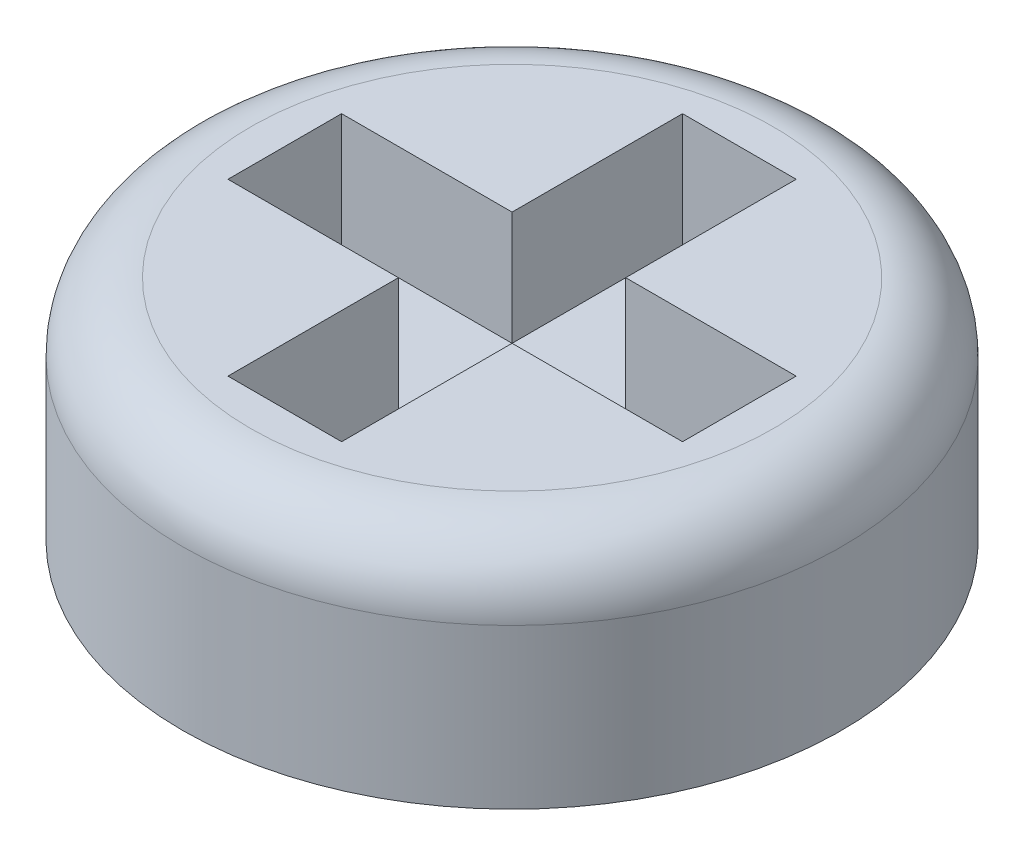
ISO-10303-21;
HEADER;
FILE_DESCRIPTION(('STEP AP214'),'2;1');
FILE_NAME('part.step','',(''),(''),'','','');
FILE_SCHEMA(('AUTOMOTIVE_DESIGN { 1 0 10303 214 1 1 1 1 }'));
ENDSEC;
DATA;
#1=APPLICATION_CONTEXT('core data for automotive mechanical design processes');
#2=APPLICATION_PROTOCOL_DEFINITION('international standard','automotive_design',2000,#1);
#3=PRODUCT_CONTEXT('',#1,'mechanical');
#4=PRODUCT('Part','Part','',(#3));
#5=PRODUCT_RELATED_PRODUCT_CATEGORY('part','',(#4));
#6=PRODUCT_DEFINITION_FORMATION('','',#4);
#7=PRODUCT_DEFINITION_CONTEXT('part definition',#1,'design');
#8=PRODUCT_DEFINITION('design','',#6,#7);
#9=PRODUCT_DEFINITION_SHAPE('','',#8);
#10=(LENGTH_UNIT() NAMED_UNIT(*) SI_UNIT(.MILLI.,.METRE.));
#11=(NAMED_UNIT(*) PLANE_ANGLE_UNIT() SI_UNIT($,.RADIAN.));
#12=(NAMED_UNIT(*) SI_UNIT($,.STERADIAN.) SOLID_ANGLE_UNIT());
#13=UNCERTAINTY_MEASURE_WITH_UNIT(LENGTH_MEASURE(1.E-05),#10,'distance_accuracy_value','');
#14=(GEOMETRIC_REPRESENTATION_CONTEXT(3) GLOBAL_UNCERTAINTY_ASSIGNED_CONTEXT((#13)) GLOBAL_UNIT_ASSIGNED_CONTEXT((#10,
#11,#12)) REPRESENTATION_CONTEXT('',''));
#15=CARTESIAN_POINT('',(0.,0.,0.));
#16=DIRECTION('',(0.,0.,1.));
#17=DIRECTION('',(1.,0.,0.));
#18=AXIS2_PLACEMENT_3D('',#15,#16,#17);
#19=CARTESIAN_POINT('',(0.,1.,0.));
#20=DIRECTION('',(0.,-1.,0.));
#21=DIRECTION('',(0.,0.,-1.));
#22=AXIS2_PLACEMENT_3D('',#19,#20,#21);
#23=CYLINDRICAL_SURFACE('',#22,1.45);
#24=CARTESIAN_POINT('',(0.,0.7,0.));
#25=DIRECTION('',(0.,1.,0.));
#26=DIRECTION('',(0.,0.,1.));
#27=AXIS2_PLACEMENT_3D('',#24,#25,#26);
#28=CIRCLE('',#27,1.45);
#29=CARTESIAN_POINT('',(0.,0.7,1.45));
#30=VERTEX_POINT('',#29);
#31=EDGE_CURVE('E11',#30,#30,#28,.F.);
#32=ORIENTED_EDGE('',*,*,#31,.T.);
#33=EDGE_LOOP('',(#32));
#34=FACE_BOUND('',#33,.T.);
#35=CARTESIAN_POINT('',(0.,0.,0.));
#36=DIRECTION('',(0.,1.,0.));
#37=DIRECTION('',(0.,0.,1.));
#38=AXIS2_PLACEMENT_3D('',#35,#36,#37);
#39=CIRCLE('',#38,1.45);
#40=CARTESIAN_POINT('',(0.,0.,1.45));
#41=VERTEX_POINT('',#40);
#42=EDGE_CURVE('E188',#41,#41,#39,.T.);
#43=ORIENTED_EDGE('',*,*,#42,.T.);
#44=EDGE_LOOP('',(#43));
#45=FACE_BOUND('',#44,.T.);
#46=ADVANCED_FACE('F32',(#34,#45),#23,.T.);
#47=CARTESIAN_POINT('',(0.,1.,0.));
#48=DIRECTION('',(0.,1.,0.));
#49=DIRECTION('',(0.,0.,1.));
#50=AXIS2_PLACEMENT_3D('',#47,#48,#49);
#51=PLANE('',#50);
#52=CARTESIAN_POINT('',(0.,1.,0.));
#53=DIRECTION('',(0.,1.,0.));
#54=DIRECTION('',(0.,0.,1.));
#55=AXIS2_PLACEMENT_3D('',#52,#53,#54);
#56=CIRCLE('',#55,1.15);
#57=CARTESIAN_POINT('',(0.,1.,1.15));
#58=VERTEX_POINT('',#57);
#59=EDGE_CURVE('E40',#58,#58,#56,.T.);
#60=ORIENTED_EDGE('',*,*,#59,.T.);
#61=EDGE_LOOP('',(#60));
#62=FACE_BOUND('',#61,.T.);
#63=DIRECTION('',(-1.,0.,0.));
#64=VECTOR('',#63,1.);
#65=CARTESIAN_POINT('',(0.25,1.,-1.));
#66=LINE('',#65,#64);
#67=CARTESIAN_POINT('',(0.25,1.,-1.));
#68=VERTEX_POINT('',#67);
#69=CARTESIAN_POINT('',(-0.25,1.,-1.));
#70=VERTEX_POINT('',#69);
#71=EDGE_CURVE('E47',#68,#70,#66,.T.);
#72=ORIENTED_EDGE('',*,*,#71,.F.);
#73=DIRECTION('',(0.,0.,-1.));
#74=VECTOR('',#73,1.);
#75=CARTESIAN_POINT('',(0.25,1.,-0.25));
#76=LINE('',#75,#74);
#77=CARTESIAN_POINT('',(0.25,1.,-0.25));
#78=VERTEX_POINT('',#77);
#79=EDGE_CURVE('E184',#78,#68,#76,.T.);
#80=ORIENTED_EDGE('',*,*,#79,.F.);
#81=DIRECTION('',(-1.,0.,0.));
#82=VECTOR('',#81,1.);
#83=CARTESIAN_POINT('',(1.,1.,-0.25));
#84=LINE('',#83,#82);
#85=CARTESIAN_POINT('',(1.,1.,-0.25));
#86=VERTEX_POINT('',#85);
#87=EDGE_CURVE('E182',#86,#78,#84,.T.);
#88=ORIENTED_EDGE('',*,*,#87,.F.);
#89=DIRECTION('',(0.,0.,-1.));
#90=VECTOR('',#89,1.);
#91=CARTESIAN_POINT('',(1.,1.,0.25));
#92=LINE('',#91,#90);
#93=CARTESIAN_POINT('',(1.,1.,0.25));
#94=VERTEX_POINT('',#93);
#95=EDGE_CURVE('E131',#94,#86,#92,.T.);
#96=ORIENTED_EDGE('',*,*,#95,.F.);
#97=DIRECTION('',(1.,0.,0.));
#98=VECTOR('',#97,1.);
#99=CARTESIAN_POINT('',(1.,1.,0.25));
#100=LINE('',#99,#98);
#101=CARTESIAN_POINT('',(0.25,1.,0.25));
#102=VERTEX_POINT('',#101);
#103=EDGE_CURVE('E178',#102,#94,#100,.T.);
#104=ORIENTED_EDGE('',*,*,#103,.F.);
#105=DIRECTION('',(0.,0.,-1.));
#106=VECTOR('',#105,1.);
#107=CARTESIAN_POINT('',(0.25,1.,1.));
#108=LINE('',#107,#106);
#109=CARTESIAN_POINT('',(0.25,1.,1.));
#110=VERTEX_POINT('',#109);
#111=EDGE_CURVE('E175',#110,#102,#108,.T.);
#112=ORIENTED_EDGE('',*,*,#111,.F.);
#113=DIRECTION('',(1.,0.,0.));
#114=VECTOR('',#113,1.);
#115=CARTESIAN_POINT('',(0.25,1.,1.));
#116=LINE('',#115,#114);
#117=CARTESIAN_POINT('',(-0.25,1.,1.));
#118=VERTEX_POINT('',#117);
#119=EDGE_CURVE('E172',#118,#110,#116,.T.);
#120=ORIENTED_EDGE('',*,*,#119,.F.);
#121=DIRECTION('',(0.,0.,1.));
#122=VECTOR('',#121,1.);
#123=CARTESIAN_POINT('',(-0.25,1.,1.));
#124=LINE('',#123,#122);
#125=CARTESIAN_POINT('',(-0.25,1.,0.25));
#126=VERTEX_POINT('',#125);
#127=EDGE_CURVE('E169',#126,#118,#124,.T.);
#128=ORIENTED_EDGE('',*,*,#127,.F.);
#129=DIRECTION('',(1.,0.,0.));
#130=VECTOR('',#129,1.);
#131=CARTESIAN_POINT('',(-0.25,1.,0.25));
#132=LINE('',#131,#130);
#133=CARTESIAN_POINT('',(-1.,1.,0.25));
#134=VERTEX_POINT('',#133);
#135=EDGE_CURVE('E166',#134,#126,#132,.T.);
#136=ORIENTED_EDGE('',*,*,#135,.F.);
#137=DIRECTION('',(0.,0.,1.));
#138=VECTOR('',#137,1.);
#139=CARTESIAN_POINT('',(-1.,1.,0.25));
#140=LINE('',#139,#138);
#141=CARTESIAN_POINT('',(-1.,1.,-0.25));
#142=VERTEX_POINT('',#141);
#143=EDGE_CURVE('E163',#142,#134,#140,.T.);
#144=ORIENTED_EDGE('',*,*,#143,.F.);
#145=DIRECTION('',(-1.,0.,0.));
#146=VECTOR('',#145,1.);
#147=CARTESIAN_POINT('',(-0.25,1.,-0.25));
#148=LINE('',#147,#146);
#149=CARTESIAN_POINT('',(-0.25,1.,-0.25));
#150=VERTEX_POINT('',#149);
#151=EDGE_CURVE('E160',#150,#142,#148,.T.);
#152=ORIENTED_EDGE('',*,*,#151,.F.);
#153=DIRECTION('',(0.,0.,1.));
#154=VECTOR('',#153,1.);
#155=CARTESIAN_POINT('',(-0.25,1.,-0.25));
#156=LINE('',#155,#154);
#157=EDGE_CURVE('E157',#70,#150,#156,.T.);
#158=ORIENTED_EDGE('',*,*,#157,.F.);
#159=EDGE_LOOP('',(#72,#80,#88,#96,#104,#112,#120,#128,#136,#144,#152,#158));
#160=FACE_BOUND('',#159,.T.);
#161=ADVANCED_FACE('F210',(#62,#160),#51,.T.);
#162=CARTESIAN_POINT('',(0.,0.,0.));
#163=DIRECTION('',(0.,1.,0.));
#164=DIRECTION('',(0.,0.,1.));
#165=AXIS2_PLACEMENT_3D('',#162,#163,#164);
#166=PLANE('',#165);
#167=ORIENTED_EDGE('',*,*,#42,.F.);
#168=EDGE_LOOP('',(#167));
#169=FACE_BOUND('',#168,.T.);
#170=ADVANCED_FACE('F226',(#169),#166,.F.);
#171=CARTESIAN_POINT('',(0.25,0.5,-1.));
#172=DIRECTION('',(0.,0.,-1.));
#173=DIRECTION('',(-1.,0.,0.));
#174=AXIS2_PLACEMENT_3D('',#171,#172,#173);
#175=PLANE('',#174);
#176=ORIENTED_EDGE('',*,*,#71,.T.);
#177=DIRECTION('',(0.,1.,0.));
#178=VECTOR('',#177,1.);
#179=CARTESIAN_POINT('',(-0.25,0.5,-1.));
#180=LINE('',#179,#178);
#181=CARTESIAN_POINT('',(-0.25,0.5,-1.));
#182=VERTEX_POINT('',#181);
#183=EDGE_CURVE('E95',#182,#70,#180,.T.);
#184=ORIENTED_EDGE('',*,*,#183,.F.);
#185=DIRECTION('',(-1.,0.,0.));
#186=VECTOR('',#185,1.);
#187=CARTESIAN_POINT('',(0.25,0.5,-1.));
#188=LINE('',#187,#186);
#189=CARTESIAN_POINT('',(0.25,0.5,-1.));
#190=VERTEX_POINT('',#189);
#191=EDGE_CURVE('E186',#190,#182,#188,.T.);
#192=ORIENTED_EDGE('',*,*,#191,.F.);
#193=DIRECTION('',(0.,1.,0.));
#194=VECTOR('',#193,1.);
#195=CARTESIAN_POINT('',(0.25,0.5,-1.));
#196=LINE('',#195,#194);
#197=EDGE_CURVE('E55',#190,#68,#196,.T.);
#198=ORIENTED_EDGE('',*,*,#197,.T.);
#199=EDGE_LOOP('',(#176,#184,#192,#198));
#200=FACE_BOUND('',#199,.T.);
#201=ADVANCED_FACE('F231',(#200),#175,.F.);
#202=CARTESIAN_POINT('',(0.25,0.5,-0.25));
#203=DIRECTION('',(1.,0.,0.));
#204=DIRECTION('',(0.,0.,-1.));
#205=AXIS2_PLACEMENT_3D('',#202,#203,#204);
#206=PLANE('',#205);
#207=ORIENTED_EDGE('',*,*,#79,.T.);
#208=ORIENTED_EDGE('',*,*,#197,.F.);
#209=DIRECTION('',(0.,0.,-1.));
#210=VECTOR('',#209,1.);
#211=CARTESIAN_POINT('',(0.25,0.5,-0.25));
#212=LINE('',#211,#210);
#213=CARTESIAN_POINT('',(0.25,0.5,-0.25));
#214=VERTEX_POINT('',#213);
#215=EDGE_CURVE('E143',#214,#190,#212,.T.);
#216=ORIENTED_EDGE('',*,*,#215,.F.);
#217=DIRECTION('',(0.,1.,0.));
#218=VECTOR('',#217,1.);
#219=CARTESIAN_POINT('',(0.25,0.5,-0.25));
#220=LINE('',#219,#218);
#221=EDGE_CURVE('E135',#214,#78,#220,.T.);
#222=ORIENTED_EDGE('',*,*,#221,.T.);
#223=EDGE_LOOP('',(#207,#208,#216,#222));
#224=FACE_BOUND('',#223,.T.);
#225=ADVANCED_FACE('F236',(#224),#206,.F.);
#226=CARTESIAN_POINT('',(1.,0.5,-0.25));
#227=DIRECTION('',(0.,0.,-1.));
#228=DIRECTION('',(-1.,0.,0.));
#229=AXIS2_PLACEMENT_3D('',#226,#227,#228);
#230=PLANE('',#229);
#231=ORIENTED_EDGE('',*,*,#87,.T.);
#232=ORIENTED_EDGE('',*,*,#221,.F.);
#233=DIRECTION('',(-1.,0.,0.));
#234=VECTOR('',#233,1.);
#235=CARTESIAN_POINT('',(1.,0.5,-0.25));
#236=LINE('',#235,#234);
#237=CARTESIAN_POINT('',(1.,0.5,-0.25));
#238=VERTEX_POINT('',#237);
#239=EDGE_CURVE('E139',#238,#214,#236,.T.);
#240=ORIENTED_EDGE('',*,*,#239,.F.);
#241=DIRECTION('',(0.,1.,0.));
#242=VECTOR('',#241,1.);
#243=CARTESIAN_POINT('',(1.,0.5,-0.25));
#244=LINE('',#243,#242);
#245=EDGE_CURVE('E124',#238,#86,#244,.T.);
#246=ORIENTED_EDGE('',*,*,#245,.T.);
#247=EDGE_LOOP('',(#231,#232,#240,#246));
#248=FACE_BOUND('',#247,.T.);
#249=ADVANCED_FACE('F140',(#248),#230,.F.);
#250=CARTESIAN_POINT('',(1.,0.5,0.25));
#251=DIRECTION('',(1.,0.,0.));
#252=DIRECTION('',(0.,0.,-1.));
#253=AXIS2_PLACEMENT_3D('',#250,#251,#252);
#254=PLANE('',#253);
#255=ORIENTED_EDGE('',*,*,#95,.T.);
#256=ORIENTED_EDGE('',*,*,#245,.F.);
#257=DIRECTION('',(0.,0.,-1.));
#258=VECTOR('',#257,1.);
#259=CARTESIAN_POINT('',(1.,0.5,0.25));
#260=LINE('',#259,#258);
#261=CARTESIAN_POINT('',(1.,0.5,0.25));
#262=VERTEX_POINT('',#261);
#263=EDGE_CURVE('E128',#262,#238,#260,.T.);
#264=ORIENTED_EDGE('',*,*,#263,.F.);
#265=DIRECTION('',(0.,1.,0.));
#266=VECTOR('',#265,1.);
#267=CARTESIAN_POINT('',(1.,0.5,0.25));
#268=LINE('',#267,#266);
#269=EDGE_CURVE('E136',#262,#94,#268,.T.);
#270=ORIENTED_EDGE('',*,*,#269,.T.);
#271=EDGE_LOOP('',(#255,#256,#264,#270));
#272=FACE_BOUND('',#271,.T.);
#273=ADVANCED_FACE('F126',(#272),#254,.F.);
#274=CARTESIAN_POINT('',(1.,0.5,0.25));
#275=DIRECTION('',(0.,0.,1.));
#276=DIRECTION('',(1.,0.,0.));
#277=AXIS2_PLACEMENT_3D('',#274,#275,#276);
#278=PLANE('',#277);
#279=ORIENTED_EDGE('',*,*,#103,.T.);
#280=ORIENTED_EDGE('',*,*,#269,.F.);
#281=DIRECTION('',(1.,0.,0.));
#282=VECTOR('',#281,1.);
#283=CARTESIAN_POINT('',(1.,0.5,0.25));
#284=LINE('',#283,#282);
#285=CARTESIAN_POINT('',(0.25,0.5,0.25));
#286=VERTEX_POINT('',#285);
#287=EDGE_CURVE('E149',#286,#262,#284,.T.);
#288=ORIENTED_EDGE('',*,*,#287,.F.);
#289=DIRECTION('',(0.,1.,0.));
#290=VECTOR('',#289,1.);
#291=CARTESIAN_POINT('',(0.25,0.5,0.25));
#292=LINE('',#291,#290);
#293=EDGE_CURVE('E191',#286,#102,#292,.T.);
#294=ORIENTED_EDGE('',*,*,#293,.T.);
#295=EDGE_LOOP('',(#279,#280,#288,#294));
#296=FACE_BOUND('',#295,.T.);
#297=ADVANCED_FACE('F263',(#296),#278,.F.);
#298=CARTESIAN_POINT('',(0.25,0.5,1.));
#299=DIRECTION('',(1.,0.,0.));
#300=DIRECTION('',(0.,0.,-1.));
#301=AXIS2_PLACEMENT_3D('',#298,#299,#300);
#302=PLANE('',#301);
#303=ORIENTED_EDGE('',*,*,#111,.T.);
#304=ORIENTED_EDGE('',*,*,#293,.F.);
#305=DIRECTION('',(0.,0.,-1.));
#306=VECTOR('',#305,1.);
#307=CARTESIAN_POINT('',(0.25,0.5,1.));
#308=LINE('',#307,#306);
#309=CARTESIAN_POINT('',(0.25,0.5,1.));
#310=VERTEX_POINT('',#309);
#311=EDGE_CURVE('E151',#310,#286,#308,.T.);
#312=ORIENTED_EDGE('',*,*,#311,.F.);
#313=DIRECTION('',(0.,1.,0.));
#314=VECTOR('',#313,1.);
#315=CARTESIAN_POINT('',(0.25,0.5,1.));
#316=LINE('',#315,#314);
#317=EDGE_CURVE('E193',#310,#110,#316,.T.);
#318=ORIENTED_EDGE('',*,*,#317,.T.);
#319=EDGE_LOOP('',(#303,#304,#312,#318));
#320=FACE_BOUND('',#319,.T.);
#321=ADVANCED_FACE('F259',(#320),#302,.F.);
#322=CARTESIAN_POINT('',(0.25,0.5,1.));
#323=DIRECTION('',(0.,0.,1.));
#324=DIRECTION('',(1.,0.,0.));
#325=AXIS2_PLACEMENT_3D('',#322,#323,#324);
#326=PLANE('',#325);
#327=ORIENTED_EDGE('',*,*,#119,.T.);
#328=ORIENTED_EDGE('',*,*,#317,.F.);
#329=DIRECTION('',(1.,0.,0.));
#330=VECTOR('',#329,1.);
#331=CARTESIAN_POINT('',(0.25,0.5,1.));
#332=LINE('',#331,#330);
#333=CARTESIAN_POINT('',(-0.25,0.5,1.));
#334=VERTEX_POINT('',#333);
#335=EDGE_CURVE('E297',#334,#310,#332,.T.);
#336=ORIENTED_EDGE('',*,*,#335,.F.);
#337=DIRECTION('',(0.,1.,0.));
#338=VECTOR('',#337,1.);
#339=CARTESIAN_POINT('',(-0.25,0.5,1.));
#340=LINE('',#339,#338);
#341=EDGE_CURVE('E195',#334,#118,#340,.T.);
#342=ORIENTED_EDGE('',*,*,#341,.T.);
#343=EDGE_LOOP('',(#327,#328,#336,#342));
#344=FACE_BOUND('',#343,.T.);
#345=ADVANCED_FACE('F255',(#344),#326,.F.);
#346=CARTESIAN_POINT('',(-0.25,0.5,1.));
#347=DIRECTION('',(-1.,0.,0.));
#348=DIRECTION('',(0.,0.,1.));
#349=AXIS2_PLACEMENT_3D('',#346,#347,#348);
#350=PLANE('',#349);
#351=ORIENTED_EDGE('',*,*,#127,.T.);
#352=ORIENTED_EDGE('',*,*,#341,.F.);
#353=DIRECTION('',(0.,0.,1.));
#354=VECTOR('',#353,1.);
#355=CARTESIAN_POINT('',(-0.25,0.5,1.));
#356=LINE('',#355,#354);
#357=CARTESIAN_POINT('',(-0.25,0.5,0.25));
#358=VERTEX_POINT('',#357);
#359=EDGE_CURVE('E294',#358,#334,#356,.T.);
#360=ORIENTED_EDGE('',*,*,#359,.F.);
#361=DIRECTION('',(0.,1.,0.));
#362=VECTOR('',#361,1.);
#363=CARTESIAN_POINT('',(-0.25,0.5,0.25));
#364=LINE('',#363,#362);
#365=EDGE_CURVE('E197',#358,#126,#364,.T.);
#366=ORIENTED_EDGE('',*,*,#365,.T.);
#367=EDGE_LOOP('',(#351,#352,#360,#366));
#368=FACE_BOUND('',#367,.T.);
#369=ADVANCED_FACE('F251',(#368),#350,.F.);
#370=CARTESIAN_POINT('',(-0.25,0.5,0.25));
#371=DIRECTION('',(0.,0.,1.));
#372=DIRECTION('',(1.,0.,0.));
#373=AXIS2_PLACEMENT_3D('',#370,#371,#372);
#374=PLANE('',#373);
#375=ORIENTED_EDGE('',*,*,#135,.T.);
#376=ORIENTED_EDGE('',*,*,#365,.F.);
#377=DIRECTION('',(1.,0.,0.));
#378=VECTOR('',#377,1.);
#379=CARTESIAN_POINT('',(-0.25,0.5,0.25));
#380=LINE('',#379,#378);
#381=CARTESIAN_POINT('',(-1.,0.5,0.25));
#382=VERTEX_POINT('',#381);
#383=EDGE_CURVE('E291',#382,#358,#380,.T.);
#384=ORIENTED_EDGE('',*,*,#383,.F.);
#385=DIRECTION('',(0.,1.,0.));
#386=VECTOR('',#385,1.);
#387=CARTESIAN_POINT('',(-1.,0.5,0.25));
#388=LINE('',#387,#386);
#389=EDGE_CURVE('E199',#382,#134,#388,.T.);
#390=ORIENTED_EDGE('',*,*,#389,.T.);
#391=EDGE_LOOP('',(#375,#376,#384,#390));
#392=FACE_BOUND('',#391,.T.);
#393=ADVANCED_FACE('F247',(#392),#374,.F.);
#394=CARTESIAN_POINT('',(-1.,0.5,0.25));
#395=DIRECTION('',(-1.,0.,0.));
#396=DIRECTION('',(0.,0.,1.));
#397=AXIS2_PLACEMENT_3D('',#394,#395,#396);
#398=PLANE('',#397);
#399=ORIENTED_EDGE('',*,*,#143,.T.);
#400=ORIENTED_EDGE('',*,*,#389,.F.);
#401=DIRECTION('',(0.,0.,1.));
#402=VECTOR('',#401,1.);
#403=CARTESIAN_POINT('',(-1.,0.5,0.25));
#404=LINE('',#403,#402);
#405=CARTESIAN_POINT('',(-1.,0.5,-0.25));
#406=VERTEX_POINT('',#405);
#407=EDGE_CURVE('E288',#406,#382,#404,.T.);
#408=ORIENTED_EDGE('',*,*,#407,.F.);
#409=DIRECTION('',(0.,1.,0.));
#410=VECTOR('',#409,1.);
#411=CARTESIAN_POINT('',(-1.,0.5,-0.25));
#412=LINE('',#411,#410);
#413=EDGE_CURVE('E201',#406,#142,#412,.T.);
#414=ORIENTED_EDGE('',*,*,#413,.T.);
#415=EDGE_LOOP('',(#399,#400,#408,#414));
#416=FACE_BOUND('',#415,.T.);
#417=ADVANCED_FACE('F243',(#416),#398,.F.);
#418=CARTESIAN_POINT('',(-0.25,0.5,-0.25));
#419=DIRECTION('',(0.,0.,-1.));
#420=DIRECTION('',(-1.,0.,0.));
#421=AXIS2_PLACEMENT_3D('',#418,#419,#420);
#422=PLANE('',#421);
#423=ORIENTED_EDGE('',*,*,#151,.T.);
#424=ORIENTED_EDGE('',*,*,#413,.F.);
#425=DIRECTION('',(-1.,0.,0.));
#426=VECTOR('',#425,1.);
#427=CARTESIAN_POINT('',(-0.25,0.5,-0.25));
#428=LINE('',#427,#426);
#429=CARTESIAN_POINT('',(-0.25,0.5,-0.25));
#430=VERTEX_POINT('',#429);
#431=EDGE_CURVE('E283',#430,#406,#428,.T.);
#432=ORIENTED_EDGE('',*,*,#431,.F.);
#433=DIRECTION('',(0.,1.,0.));
#434=VECTOR('',#433,1.);
#435=CARTESIAN_POINT('',(-0.25,0.5,-0.25));
#436=LINE('',#435,#434);
#437=EDGE_CURVE('E203',#430,#150,#436,.T.);
#438=ORIENTED_EDGE('',*,*,#437,.T.);
#439=EDGE_LOOP('',(#423,#424,#432,#438));
#440=FACE_BOUND('',#439,.T.);
#441=ADVANCED_FACE('F239',(#440),#422,.F.);
#442=CARTESIAN_POINT('',(-0.25,0.5,-0.25));
#443=DIRECTION('',(-1.,0.,0.));
#444=DIRECTION('',(0.,0.,1.));
#445=AXIS2_PLACEMENT_3D('',#442,#443,#444);
#446=PLANE('',#445);
#447=ORIENTED_EDGE('',*,*,#157,.T.);
#448=ORIENTED_EDGE('',*,*,#437,.F.);
#449=DIRECTION('',(0.,0.,1.));
#450=VECTOR('',#449,1.);
#451=CARTESIAN_POINT('',(-0.25,0.5,-0.25));
#452=LINE('',#451,#450);
#453=EDGE_CURVE('E281',#182,#430,#452,.T.);
#454=ORIENTED_EDGE('',*,*,#453,.F.);
#455=ORIENTED_EDGE('',*,*,#183,.T.);
#456=EDGE_LOOP('',(#447,#448,#454,#455));
#457=FACE_BOUND('',#456,.T.);
#458=ADVANCED_FACE('F218',(#457),#446,.F.);
#459=CARTESIAN_POINT('',(0.,0.5,0.));
#460=DIRECTION('',(0.,-1.,0.));
#461=DIRECTION('',(0.,0.,-1.));
#462=AXIS2_PLACEMENT_3D('',#459,#460,#461);
#463=PLANE('',#462);
#464=ORIENTED_EDGE('',*,*,#191,.T.);
#465=ORIENTED_EDGE('',*,*,#453,.T.);
#466=ORIENTED_EDGE('',*,*,#431,.T.);
#467=ORIENTED_EDGE('',*,*,#407,.T.);
#468=ORIENTED_EDGE('',*,*,#383,.T.);
#469=ORIENTED_EDGE('',*,*,#359,.T.);
#470=ORIENTED_EDGE('',*,*,#335,.T.);
#471=ORIENTED_EDGE('',*,*,#311,.T.);
#472=ORIENTED_EDGE('',*,*,#287,.T.);
#473=ORIENTED_EDGE('',*,*,#263,.T.);
#474=ORIENTED_EDGE('',*,*,#239,.T.);
#475=ORIENTED_EDGE('',*,*,#215,.T.);
#476=EDGE_LOOP('',(#464,#465,#466,#467,#468,#469,#470,#471,#472,#473,#474,#475));
#477=FACE_BOUND('',#476,.T.);
#478=ADVANCED_FACE('F146',(#477),#463,.F.);
#479=CARTESIAN_POINT('',(0.,0.7,0.));
#480=DIRECTION('',(0.,1.,0.));
#481=DIRECTION('',(0.,0.,1.));
#482=AXIS2_PLACEMENT_3D('',#479,#480,#481);
#483=TOROIDAL_SURFACE('',#482,1.15,0.3);
#484=ORIENTED_EDGE('',*,*,#31,.F.);
#485=EDGE_LOOP('',(#484));
#486=FACE_BOUND('',#485,.T.);
#487=ORIENTED_EDGE('',*,*,#59,.F.);
#488=EDGE_LOOP('',(#487));
#489=FACE_BOUND('',#488,.T.);
#490=ADVANCED_FACE('F34',(#486,#489),#483,.T.);
#491=CLOSED_SHELL('',(#46,#161,#170,#201,#225,#249,#273,#297,#321,#345,#369,#393,#417,#441,#458,
#478,#490));
#492=MANIFOLD_SOLID_BREP('B2',#491);
#493=ADVANCED_BREP_SHAPE_REPRESENTATION('',(#18,#492),#14);
#494=SHAPE_DEFINITION_REPRESENTATION(#9,#493);
ENDSEC;
END-ISO-10303-21;
